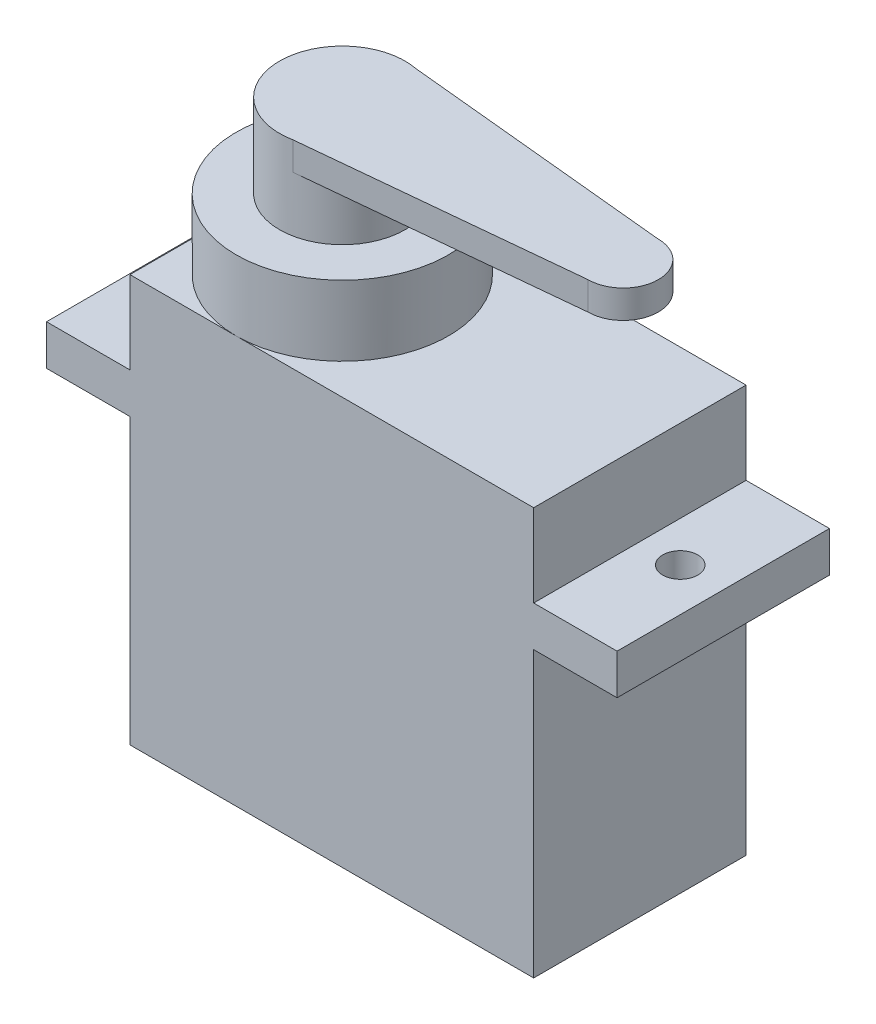
ISO-10303-21;
HEADER;
FILE_DESCRIPTION(('STEP AP214'),'2;1');
FILE_NAME('part.step','',(''),(''),'','','');
FILE_SCHEMA(('AUTOMOTIVE_DESIGN { 1 0 10303 214 1 1 1 1 }'));
ENDSEC;
DATA;
#1=APPLICATION_CONTEXT('core data for automotive mechanical design processes');
#2=APPLICATION_PROTOCOL_DEFINITION('international standard','automotive_design',2000,#1);
#3=PRODUCT_CONTEXT('',#1,'mechanical');
#4=PRODUCT('Part','Part','',(#3));
#5=PRODUCT_RELATED_PRODUCT_CATEGORY('part','',(#4));
#6=PRODUCT_DEFINITION_FORMATION('','',#4);
#7=PRODUCT_DEFINITION_CONTEXT('part definition',#1,'design');
#8=PRODUCT_DEFINITION('design','',#6,#7);
#9=PRODUCT_DEFINITION_SHAPE('','',#8);
#10=(LENGTH_UNIT() NAMED_UNIT(*) SI_UNIT(.MILLI.,.METRE.));
#11=(NAMED_UNIT(*) PLANE_ANGLE_UNIT() SI_UNIT($,.RADIAN.));
#12=(NAMED_UNIT(*) SI_UNIT($,.STERADIAN.) SOLID_ANGLE_UNIT());
#13=UNCERTAINTY_MEASURE_WITH_UNIT(LENGTH_MEASURE(1.E-05),#10,'distance_accuracy_value','');
#14=(GEOMETRIC_REPRESENTATION_CONTEXT(3) GLOBAL_UNCERTAINTY_ASSIGNED_CONTEXT((#13)) GLOBAL_UNIT_ASSIGNED_CONTEXT((#10,
#11,#12)) REPRESENTATION_CONTEXT('',''));
#15=CARTESIAN_POINT('',(0.,0.,0.));
#16=DIRECTION('',(0.,0.,1.));
#17=DIRECTION('',(1.,0.,0.));
#18=AXIS2_PLACEMENT_3D('',#15,#16,#17);
#19=CARTESIAN_POINT('',(0.,23.2,0.));
#20=DIRECTION('',(0.,1.,0.));
#21=DIRECTION('',(0.,0.,1.));
#22=AXIS2_PLACEMENT_3D('',#19,#20,#21);
#23=PLANE('',#22);
#24=CARTESIAN_POINT('',(-5.45,23.2,0.));
#25=DIRECTION('',(0.,1.,0.));
#26=DIRECTION('',(0.,0.,1.));
#27=AXIS2_PLACEMENT_3D('',#24,#25,#26);
#28=CIRCLE('',#27,6.05);
#29=CARTESIAN_POINT('',(-5.45,23.2,6.05));
#30=VERTEX_POINT('',#29);
#31=CARTESIAN_POINT('',(-5.45,23.2,-6.05));
#32=VERTEX_POINT('',#31);
#33=EDGE_CURVE('E216',#30,#32,#28,.T.);
#34=ORIENTED_EDGE('',*,*,#33,.F.);
#35=DIRECTION('',(1.,0.,0.));
#36=VECTOR('',#35,1.);
#37=CARTESIAN_POINT('',(11.5,23.2,6.05));
#38=LINE('',#37,#36);
#39=CARTESIAN_POINT('',(11.5,23.2,6.05));
#40=VERTEX_POINT('',#39);
#41=EDGE_CURVE('E319',#30,#40,#38,.T.);
#42=ORIENTED_EDGE('',*,*,#41,.T.);
#43=DIRECTION('',(0.,0.,-1.));
#44=VECTOR('',#43,1.);
#45=CARTESIAN_POINT('',(11.5,23.2,6.05));
#46=LINE('',#45,#44);
#47=CARTESIAN_POINT('',(11.5,23.2,-6.05));
#48=VERTEX_POINT('',#47);
#49=EDGE_CURVE('E324',#40,#48,#46,.T.);
#50=ORIENTED_EDGE('',*,*,#49,.T.);
#51=DIRECTION('',(-1.,0.,0.));
#52=VECTOR('',#51,1.);
#53=CARTESIAN_POINT('',(11.5,23.2,-6.05));
#54=LINE('',#53,#52);
#55=EDGE_CURVE('E328',#48,#32,#54,.T.);
#56=ORIENTED_EDGE('',*,*,#55,.T.);
#57=EDGE_LOOP('',(#34,#42,#50,#56));
#58=FACE_BOUND('',#57,.T.);
#59=ADVANCED_FACE('F41',(#58),#23,.T.);
#60=CARTESIAN_POINT('',(-11.5,23.2,0.));
#61=VERTEX_POINT('',#60);
#62=EDGE_CURVE('E51',#32,#61,#28,.T.);
#63=ORIENTED_EDGE('',*,*,#62,.F.);
#64=CARTESIAN_POINT('',(-11.5,23.2,-6.05));
#65=VERTEX_POINT('',#64);
#66=EDGE_CURVE('E327',#32,#65,#54,.T.);
#67=ORIENTED_EDGE('',*,*,#66,.T.);
#68=DIRECTION('',(0.,0.,1.));
#69=VECTOR('',#68,1.);
#70=CARTESIAN_POINT('',(-11.5,23.2,6.05));
#71=LINE('',#70,#69);
#72=EDGE_CURVE('E316',#65,#61,#71,.T.);
#73=ORIENTED_EDGE('',*,*,#72,.T.);
#74=EDGE_LOOP('',(#63,#67,#73));
#75=FACE_BOUND('',#74,.T.);
#76=ADVANCED_FACE('F410',(#75),#23,.T.);
#77=CARTESIAN_POINT('',(-11.5,23.2,6.05));
#78=DIRECTION('',(1.,0.,0.));
#79=DIRECTION('',(0.,0.,-1.));
#80=AXIS2_PLACEMENT_3D('',#77,#78,#79);
#81=PLANE('',#80);
#82=DIRECTION('',(0.,-1.,0.));
#83=VECTOR('',#82,1.);
#84=CARTESIAN_POINT('',(-11.5,23.2,6.05));
#85=LINE('',#84,#83);
#86=CARTESIAN_POINT('',(-11.5,16.2,6.05));
#87=VERTEX_POINT('',#86);
#88=CARTESIAN_POINT('',(-11.5,0.,6.05));
#89=VERTEX_POINT('',#88);
#90=EDGE_CURVE('E359',#87,#89,#85,.T.);
#91=ORIENTED_EDGE('',*,*,#90,.F.);
#92=DIRECTION('',(0.,0.,-1.));
#93=VECTOR('',#92,1.);
#94=CARTESIAN_POINT('',(-11.5,16.2,6.05));
#95=LINE('',#94,#93);
#96=CARTESIAN_POINT('',(-11.5,16.2,-6.05));
#97=VERTEX_POINT('',#96);
#98=EDGE_CURVE('E240',#87,#97,#95,.T.);
#99=ORIENTED_EDGE('',*,*,#98,.T.);
#100=DIRECTION('',(0.,-1.,0.));
#101=VECTOR('',#100,1.);
#102=CARTESIAN_POINT('',(-11.5,23.2,-6.05));
#103=LINE('',#102,#101);
#104=CARTESIAN_POINT('',(-11.5,0.,-6.05));
#105=VERTEX_POINT('',#104);
#106=EDGE_CURVE('E332',#97,#105,#103,.T.);
#107=ORIENTED_EDGE('',*,*,#106,.T.);
#108=DIRECTION('',(0.,0.,1.));
#109=VECTOR('',#108,1.);
#110=CARTESIAN_POINT('',(-11.5,0.,6.05));
#111=LINE('',#110,#109);
#112=EDGE_CURVE('E315',#105,#89,#111,.T.);
#113=ORIENTED_EDGE('',*,*,#112,.T.);
#114=EDGE_LOOP('',(#91,#99,#107,#113));
#115=FACE_BOUND('',#114,.T.);
#116=ADVANCED_FACE('F412',(#115),#81,.F.);
#117=CARTESIAN_POINT('',(11.5,23.2,6.05));
#118=DIRECTION('',(-1.,0.,0.));
#119=DIRECTION('',(0.,0.,1.));
#120=AXIS2_PLACEMENT_3D('',#117,#118,#119);
#121=PLANE('',#120);
#122=DIRECTION('',(0.,0.,1.));
#123=VECTOR('',#122,1.);
#124=CARTESIAN_POINT('',(11.5,18.5,6.05));
#125=LINE('',#124,#123);
#126=CARTESIAN_POINT('',(11.5,18.5,-6.05));
#127=VERTEX_POINT('',#126);
#128=CARTESIAN_POINT('',(11.5,18.5,6.05));
#129=VERTEX_POINT('',#128);
#130=EDGE_CURVE('E284',#127,#129,#125,.T.);
#131=ORIENTED_EDGE('',*,*,#130,.F.);
#132=DIRECTION('',(0.,-1.,0.));
#133=VECTOR('',#132,1.);
#134=CARTESIAN_POINT('',(11.5,23.2,-6.05));
#135=LINE('',#134,#133);
#136=EDGE_CURVE('E353',#48,#127,#135,.T.);
#137=ORIENTED_EDGE('',*,*,#136,.F.);
#138=ORIENTED_EDGE('',*,*,#49,.F.);
#139=DIRECTION('',(0.,-1.,0.));
#140=VECTOR('',#139,1.);
#141=CARTESIAN_POINT('',(11.5,23.2,6.05));
#142=LINE('',#141,#140);
#143=EDGE_CURVE('E357',#40,#129,#142,.T.);
#144=ORIENTED_EDGE('',*,*,#143,.T.);
#145=EDGE_LOOP('',(#131,#137,#138,#144));
#146=FACE_BOUND('',#145,.T.);
#147=ADVANCED_FACE('F418',(#146),#121,.F.);
#148=DIRECTION('',(0.,0.,-1.));
#149=VECTOR('',#148,1.);
#150=CARTESIAN_POINT('',(11.5,16.2,6.05));
#151=LINE('',#150,#149);
#152=CARTESIAN_POINT('',(11.5,16.2,6.05));
#153=VERTEX_POINT('',#152);
#154=CARTESIAN_POINT('',(11.5,16.2,-6.05));
#155=VERTEX_POINT('',#154);
#156=EDGE_CURVE('E278',#153,#155,#151,.T.);
#157=ORIENTED_EDGE('',*,*,#156,.F.);
#158=CARTESIAN_POINT('',(11.5,0.,6.05));
#159=VERTEX_POINT('',#158);
#160=EDGE_CURVE('E356',#153,#159,#142,.T.);
#161=ORIENTED_EDGE('',*,*,#160,.T.);
#162=DIRECTION('',(0.,0.,-1.));
#163=VECTOR('',#162,1.);
#164=CARTESIAN_POINT('',(11.5,0.,6.05));
#165=LINE('',#164,#163);
#166=CARTESIAN_POINT('',(11.5,0.,-6.05));
#167=VERTEX_POINT('',#166);
#168=EDGE_CURVE('E340',#159,#167,#165,.T.);
#169=ORIENTED_EDGE('',*,*,#168,.T.);
#170=EDGE_CURVE('E352',#155,#167,#135,.T.);
#171=ORIENTED_EDGE('',*,*,#170,.F.);
#172=EDGE_LOOP('',(#157,#161,#169,#171));
#173=FACE_BOUND('',#172,.T.);
#174=ADVANCED_FACE('F367',(#173),#121,.F.);
#175=CARTESIAN_POINT('',(-11.5,18.5,-6.05));
#176=VERTEX_POINT('',#175);
#177=EDGE_CURVE('E348',#65,#176,#103,.T.);
#178=ORIENTED_EDGE('',*,*,#177,.T.);
#179=DIRECTION('',(0.,0.,1.));
#180=VECTOR('',#179,1.);
#181=CARTESIAN_POINT('',(-11.5,18.5,6.05));
#182=LINE('',#181,#180);
#183=CARTESIAN_POINT('',(-11.5,18.5,6.05));
#184=VERTEX_POINT('',#183);
#185=EDGE_CURVE('E234',#176,#184,#182,.T.);
#186=ORIENTED_EDGE('',*,*,#185,.T.);
#187=CARTESIAN_POINT('',(-11.5,23.2,6.05));
#188=VERTEX_POINT('',#187);
#189=EDGE_CURVE('E45',#188,#184,#85,.T.);
#190=ORIENTED_EDGE('',*,*,#189,.F.);
#191=EDGE_CURVE('E320',#61,#188,#71,.T.);
#192=ORIENTED_EDGE('',*,*,#191,.F.);
#193=ORIENTED_EDGE('',*,*,#72,.F.);
#194=EDGE_LOOP('',(#178,#186,#190,#192,#193));
#195=FACE_BOUND('',#194,.T.);
#196=ADVANCED_FACE('F43',(#195),#81,.F.);
#197=CARTESIAN_POINT('',(11.5,23.2,6.05));
#198=DIRECTION('',(0.,0.,-1.));
#199=DIRECTION('',(-1.,0.,0.));
#200=AXIS2_PLACEMENT_3D('',#197,#198,#199);
#201=PLANE('',#200);
#202=DIRECTION('',(1.,0.,0.));
#203=VECTOR('',#202,1.);
#204=CARTESIAN_POINT('',(11.5,0.,6.05));
#205=LINE('',#204,#203);
#206=EDGE_CURVE('E336',#89,#159,#205,.T.);
#207=ORIENTED_EDGE('',*,*,#206,.T.);
#208=ORIENTED_EDGE('',*,*,#160,.F.);
#209=DIRECTION('',(-1.,0.,0.));
#210=VECTOR('',#209,1.);
#211=CARTESIAN_POINT('',(16.25,16.2,6.05));
#212=LINE('',#211,#210);
#213=CARTESIAN_POINT('',(16.25,16.2,6.05));
#214=VERTEX_POINT('',#213);
#215=EDGE_CURVE('E311',#214,#153,#212,.T.);
#216=ORIENTED_EDGE('',*,*,#215,.F.);
#217=DIRECTION('',(0.,-1.,0.));
#218=VECTOR('',#217,1.);
#219=CARTESIAN_POINT('',(16.25,18.5,6.05));
#220=LINE('',#219,#218);
#221=CARTESIAN_POINT('',(16.25,18.5,6.05));
#222=VERTEX_POINT('',#221);
#223=EDGE_CURVE('E279',#222,#214,#220,.T.);
#224=ORIENTED_EDGE('',*,*,#223,.F.);
#225=DIRECTION('',(-1.,0.,0.));
#226=VECTOR('',#225,1.);
#227=CARTESIAN_POINT('',(16.25,18.5,6.05));
#228=LINE('',#227,#226);
#229=EDGE_CURVE('E293',#222,#129,#228,.T.);
#230=ORIENTED_EDGE('',*,*,#229,.T.);
#231=ORIENTED_EDGE('',*,*,#143,.F.);
#232=ORIENTED_EDGE('',*,*,#41,.F.);
#233=EDGE_CURVE('E321',#188,#30,#38,.T.);
#234=ORIENTED_EDGE('',*,*,#233,.F.);
#235=ORIENTED_EDGE('',*,*,#189,.T.);
#236=DIRECTION('',(1.,0.,0.));
#237=VECTOR('',#236,1.);
#238=CARTESIAN_POINT('',(-16.25,18.5,6.05));
#239=LINE('',#238,#237);
#240=CARTESIAN_POINT('',(-16.25,18.5,6.05));
#241=VERTEX_POINT('',#240);
#242=EDGE_CURVE('E267',#241,#184,#239,.T.);
#243=ORIENTED_EDGE('',*,*,#242,.F.);
#244=DIRECTION('',(0.,-1.,0.));
#245=VECTOR('',#244,1.);
#246=CARTESIAN_POINT('',(-16.25,18.5,6.05));
#247=LINE('',#246,#245);
#248=CARTESIAN_POINT('',(-16.25,16.2,6.05));
#249=VERTEX_POINT('',#248);
#250=EDGE_CURVE('E235',#241,#249,#247,.T.);
#251=ORIENTED_EDGE('',*,*,#250,.T.);
#252=DIRECTION('',(1.,0.,0.));
#253=VECTOR('',#252,1.);
#254=CARTESIAN_POINT('',(-16.25,16.2,6.05));
#255=LINE('',#254,#253);
#256=EDGE_CURVE('E252',#249,#87,#255,.T.);
#257=ORIENTED_EDGE('',*,*,#256,.T.);
#258=ORIENTED_EDGE('',*,*,#90,.T.);
#259=EDGE_LOOP('',(#207,#208,#216,#224,#230,#231,#232,#234,#235,#243,#251,#257,#258));
#260=FACE_BOUND('',#259,.T.);
#261=ADVANCED_FACE('F373',(#260),#201,.F.);
#262=CARTESIAN_POINT('',(11.5,23.2,-6.05));
#263=DIRECTION('',(0.,0.,1.));
#264=DIRECTION('',(1.,0.,0.));
#265=AXIS2_PLACEMENT_3D('',#262,#263,#264);
#266=PLANE('',#265);
#267=DIRECTION('',(-1.,0.,0.));
#268=VECTOR('',#267,1.);
#269=CARTESIAN_POINT('',(11.5,0.,-6.05));
#270=LINE('',#269,#268);
#271=EDGE_CURVE('E344',#167,#105,#270,.T.);
#272=ORIENTED_EDGE('',*,*,#271,.T.);
#273=ORIENTED_EDGE('',*,*,#106,.F.);
#274=DIRECTION('',(1.,0.,0.));
#275=VECTOR('',#274,1.);
#276=CARTESIAN_POINT('',(-16.25,16.2,-6.05));
#277=LINE('',#276,#275);
#278=CARTESIAN_POINT('',(-16.25,16.2,-6.05));
#279=VERTEX_POINT('',#278);
#280=EDGE_CURVE('E261',#279,#97,#277,.T.);
#281=ORIENTED_EDGE('',*,*,#280,.F.);
#282=DIRECTION('',(0.,1.,0.));
#283=VECTOR('',#282,1.);
#284=CARTESIAN_POINT('',(-16.25,18.5,-6.05));
#285=LINE('',#284,#283);
#286=CARTESIAN_POINT('',(-16.25,18.5,-6.05));
#287=VERTEX_POINT('',#286);
#288=EDGE_CURVE('E244',#279,#287,#285,.T.);
#289=ORIENTED_EDGE('',*,*,#288,.T.);
#290=DIRECTION('',(1.,0.,0.));
#291=VECTOR('',#290,1.);
#292=CARTESIAN_POINT('',(-16.25,18.5,-6.05));
#293=LINE('',#292,#291);
#294=EDGE_CURVE('E264',#287,#176,#293,.T.);
#295=ORIENTED_EDGE('',*,*,#294,.T.);
#296=ORIENTED_EDGE('',*,*,#177,.F.);
#297=ORIENTED_EDGE('',*,*,#66,.F.);
#298=ORIENTED_EDGE('',*,*,#55,.F.);
#299=ORIENTED_EDGE('',*,*,#136,.T.);
#300=DIRECTION('',(-1.,0.,0.));
#301=VECTOR('',#300,1.);
#302=CARTESIAN_POINT('',(16.25,18.5,-6.05));
#303=LINE('',#302,#301);
#304=CARTESIAN_POINT('',(16.25,18.5,-6.05));
#305=VERTEX_POINT('',#304);
#306=EDGE_CURVE('E303',#305,#127,#303,.T.);
#307=ORIENTED_EDGE('',*,*,#306,.F.);
#308=DIRECTION('',(0.,1.,0.));
#309=VECTOR('',#308,1.);
#310=CARTESIAN_POINT('',(16.25,18.5,-6.05));
#311=LINE('',#310,#309);
#312=CARTESIAN_POINT('',(16.25,16.2,-6.05));
#313=VERTEX_POINT('',#312);
#314=EDGE_CURVE('E287',#313,#305,#311,.T.);
#315=ORIENTED_EDGE('',*,*,#314,.F.);
#316=DIRECTION('',(-1.,0.,0.));
#317=VECTOR('',#316,1.);
#318=CARTESIAN_POINT('',(16.25,16.2,-6.05));
#319=LINE('',#318,#317);
#320=EDGE_CURVE('E307',#313,#155,#319,.T.);
#321=ORIENTED_EDGE('',*,*,#320,.T.);
#322=ORIENTED_EDGE('',*,*,#170,.T.);
#323=EDGE_LOOP('',(#272,#273,#281,#289,#295,#296,#297,#298,#299,#307,#315,#321,#322));
#324=FACE_BOUND('',#323,.T.);
#325=ADVANCED_FACE('F380',(#324),#266,.F.);
#326=EDGE_CURVE('E226',#61,#30,#28,.T.);
#327=ORIENTED_EDGE('',*,*,#326,.F.);
#328=ORIENTED_EDGE('',*,*,#191,.T.);
#329=ORIENTED_EDGE('',*,*,#233,.T.);
#330=EDGE_LOOP('',(#327,#328,#329));
#331=FACE_BOUND('',#330,.T.);
#332=ADVANCED_FACE('F391',(#331),#23,.T.);
#333=CARTESIAN_POINT('',(0.,0.,0.));
#334=DIRECTION('',(0.,1.,0.));
#335=DIRECTION('',(0.,0.,1.));
#336=AXIS2_PLACEMENT_3D('',#333,#334,#335);
#337=PLANE('',#336);
#338=ORIENTED_EDGE('',*,*,#112,.F.);
#339=ORIENTED_EDGE('',*,*,#271,.F.);
#340=ORIENTED_EDGE('',*,*,#168,.F.);
#341=ORIENTED_EDGE('',*,*,#206,.F.);
#342=EDGE_LOOP('',(#338,#339,#340,#341));
#343=FACE_BOUND('',#342,.T.);
#344=ADVANCED_FACE('F377',(#343),#337,.F.);
#345=CARTESIAN_POINT('',(16.25,16.2,6.05));
#346=DIRECTION('',(0.,1.,0.));
#347=DIRECTION('',(0.,0.,1.));
#348=AXIS2_PLACEMENT_3D('',#345,#346,#347);
#349=PLANE('',#348);
#350=CARTESIAN_POINT('',(13.8,16.2,0.));
#351=DIRECTION('',(0.,1.,0.));
#352=DIRECTION('',(0.,0.,1.));
#353=AXIS2_PLACEMENT_3D('',#350,#351,#352);
#354=CIRCLE('',#353,1.);
#355=CARTESIAN_POINT('',(13.8,16.2,1.));
#356=VERTEX_POINT('',#355);
#357=EDGE_CURVE('E274',#356,#356,#354,.F.);
#358=ORIENTED_EDGE('',*,*,#357,.F.);
#359=EDGE_LOOP('',(#358));
#360=FACE_BOUND('',#359,.T.);
#361=ORIENTED_EDGE('',*,*,#156,.T.);
#362=ORIENTED_EDGE('',*,*,#320,.F.);
#363=DIRECTION('',(0.,0.,-1.));
#364=VECTOR('',#363,1.);
#365=CARTESIAN_POINT('',(16.25,16.2,6.05));
#366=LINE('',#365,#364);
#367=EDGE_CURVE('E283',#214,#313,#366,.T.);
#368=ORIENTED_EDGE('',*,*,#367,.F.);
#369=ORIENTED_EDGE('',*,*,#215,.T.);
#370=EDGE_LOOP('',(#361,#362,#368,#369));
#371=FACE_BOUND('',#370,.T.);
#372=ADVANCED_FACE('F427',(#360,#371),#349,.F.);
#373=CARTESIAN_POINT('',(16.25,18.5,6.05));
#374=DIRECTION('',(0.,-1.,0.));
#375=DIRECTION('',(0.,0.,-1.));
#376=AXIS2_PLACEMENT_3D('',#373,#374,#375);
#377=PLANE('',#376);
#378=CARTESIAN_POINT('',(13.8,18.5,0.));
#379=DIRECTION('',(0.,1.,0.));
#380=DIRECTION('',(0.,0.,1.));
#381=AXIS2_PLACEMENT_3D('',#378,#379,#380);
#382=CIRCLE('',#381,1.);
#383=CARTESIAN_POINT('',(13.8,18.5,1.));
#384=VERTEX_POINT('',#383);
#385=EDGE_CURVE('E270',#384,#384,#382,.T.);
#386=ORIENTED_EDGE('',*,*,#385,.F.);
#387=EDGE_LOOP('',(#386));
#388=FACE_BOUND('',#387,.T.);
#389=ORIENTED_EDGE('',*,*,#130,.T.);
#390=ORIENTED_EDGE('',*,*,#229,.F.);
#391=DIRECTION('',(0.,0.,1.));
#392=VECTOR('',#391,1.);
#393=CARTESIAN_POINT('',(16.25,18.5,6.05));
#394=LINE('',#393,#392);
#395=EDGE_CURVE('E290',#305,#222,#394,.T.);
#396=ORIENTED_EDGE('',*,*,#395,.F.);
#397=ORIENTED_EDGE('',*,*,#306,.T.);
#398=EDGE_LOOP('',(#389,#390,#396,#397));
#399=FACE_BOUND('',#398,.T.);
#400=ADVANCED_FACE('F439',(#388,#399),#377,.F.);
#401=CARTESIAN_POINT('',(16.25,0.,0.));
#402=DIRECTION('',(1.,0.,0.));
#403=DIRECTION('',(0.,0.,-1.));
#404=AXIS2_PLACEMENT_3D('',#401,#402,#403);
#405=PLANE('',#404);
#406=ORIENTED_EDGE('',*,*,#223,.T.);
#407=ORIENTED_EDGE('',*,*,#367,.T.);
#408=ORIENTED_EDGE('',*,*,#314,.T.);
#409=ORIENTED_EDGE('',*,*,#395,.T.);
#410=EDGE_LOOP('',(#406,#407,#408,#409));
#411=FACE_BOUND('',#410,.T.);
#412=ADVANCED_FACE('F443',(#411),#405,.T.);
#413=CARTESIAN_POINT('',(13.8,13.3715728752538,0.));
#414=DIRECTION('',(0.,1.,0.));
#415=DIRECTION('',(0.,0.,1.));
#416=AXIS2_PLACEMENT_3D('',#413,#414,#415);
#417=CYLINDRICAL_SURFACE('',#416,1.);
#418=ORIENTED_EDGE('',*,*,#357,.T.);
#419=EDGE_LOOP('',(#418));
#420=FACE_BOUND('',#419,.T.);
#421=ORIENTED_EDGE('',*,*,#385,.T.);
#422=EDGE_LOOP('',(#421));
#423=FACE_BOUND('',#422,.T.);
#424=ADVANCED_FACE('F456',(#420,#423),#417,.F.);
#425=CARTESIAN_POINT('',(-16.25,18.5,6.05));
#426=DIRECTION('',(0.,1.,0.));
#427=DIRECTION('',(0.,0.,1.));
#428=AXIS2_PLACEMENT_3D('',#425,#426,#427);
#429=PLANE('',#428);
#430=CARTESIAN_POINT('',(-13.8,18.5,0.));
#431=DIRECTION('',(0.,-1.,0.));
#432=DIRECTION('',(0.,0.,1.));
#433=AXIS2_PLACEMENT_3D('',#430,#431,#432);
#434=CIRCLE('',#433,1.);
#435=CARTESIAN_POINT('',(-13.8,18.5,1.));
#436=VERTEX_POINT('',#435);
#437=EDGE_CURVE('E222',#436,#436,#434,.T.);
#438=ORIENTED_EDGE('',*,*,#437,.T.);
#439=EDGE_LOOP('',(#438));
#440=FACE_BOUND('',#439,.T.);
#441=ORIENTED_EDGE('',*,*,#185,.F.);
#442=ORIENTED_EDGE('',*,*,#294,.F.);
#443=DIRECTION('',(0.,0.,1.));
#444=VECTOR('',#443,1.);
#445=CARTESIAN_POINT('',(-16.25,18.5,6.05));
#446=LINE('',#445,#444);
#447=EDGE_CURVE('E239',#287,#241,#446,.T.);
#448=ORIENTED_EDGE('',*,*,#447,.T.);
#449=ORIENTED_EDGE('',*,*,#242,.T.);
#450=EDGE_LOOP('',(#441,#442,#448,#449));
#451=FACE_BOUND('',#450,.T.);
#452=ADVANCED_FACE('F459',(#440,#451),#429,.T.);
#453=CARTESIAN_POINT('',(-16.25,16.2,6.05));
#454=DIRECTION('',(0.,-1.,0.));
#455=DIRECTION('',(0.,0.,-1.));
#456=AXIS2_PLACEMENT_3D('',#453,#454,#455);
#457=PLANE('',#456);
#458=CARTESIAN_POINT('',(-13.8,16.2,0.));
#459=DIRECTION('',(0.,1.,0.));
#460=DIRECTION('',(0.,0.,1.));
#461=AXIS2_PLACEMENT_3D('',#458,#459,#460);
#462=CIRCLE('',#461,1.);
#463=CARTESIAN_POINT('',(-13.8,16.2,1.));
#464=VERTEX_POINT('',#463);
#465=EDGE_CURVE('E230',#464,#464,#462,.T.);
#466=ORIENTED_EDGE('',*,*,#465,.T.);
#467=EDGE_LOOP('',(#466));
#468=FACE_BOUND('',#467,.T.);
#469=ORIENTED_EDGE('',*,*,#98,.F.);
#470=ORIENTED_EDGE('',*,*,#256,.F.);
#471=DIRECTION('',(0.,0.,-1.));
#472=VECTOR('',#471,1.);
#473=CARTESIAN_POINT('',(-16.25,16.2,6.05));
#474=LINE('',#473,#472);
#475=EDGE_CURVE('E248',#249,#279,#474,.T.);
#476=ORIENTED_EDGE('',*,*,#475,.T.);
#477=ORIENTED_EDGE('',*,*,#280,.T.);
#478=EDGE_LOOP('',(#469,#470,#476,#477));
#479=FACE_BOUND('',#478,.T.);
#480=ADVANCED_FACE('F463',(#468,#479),#457,.T.);
#481=CARTESIAN_POINT('',(-16.25,0.,0.));
#482=DIRECTION('',(-1.,0.,0.));
#483=DIRECTION('',(0.,0.,-1.));
#484=AXIS2_PLACEMENT_3D('',#481,#482,#483);
#485=PLANE('',#484);
#486=ORIENTED_EDGE('',*,*,#250,.F.);
#487=ORIENTED_EDGE('',*,*,#447,.F.);
#488=ORIENTED_EDGE('',*,*,#288,.F.);
#489=ORIENTED_EDGE('',*,*,#475,.F.);
#490=EDGE_LOOP('',(#486,#487,#488,#489));
#491=FACE_BOUND('',#490,.T.);
#492=ADVANCED_FACE('F467',(#491),#485,.T.);
#493=CARTESIAN_POINT('',(-13.8,13.3715728752538,0.));
#494=DIRECTION('',(0.,1.,0.));
#495=DIRECTION('',(0.,0.,1.));
#496=AXIS2_PLACEMENT_3D('',#493,#494,#495);
#497=CYLINDRICAL_SURFACE('',#496,1.);
#498=ORIENTED_EDGE('',*,*,#465,.F.);
#499=EDGE_LOOP('',(#498));
#500=FACE_BOUND('',#499,.T.);
#501=ORIENTED_EDGE('',*,*,#437,.F.);
#502=EDGE_LOOP('',(#501));
#503=FACE_BOUND('',#502,.T.);
#504=ADVANCED_FACE('F471',(#500,#503),#497,.F.);
#505=CARTESIAN_POINT('',(-5.45,27.2,0.));
#506=DIRECTION('',(0.,-1.,0.));
#507=DIRECTION('',(0.,0.,-1.));
#508=AXIS2_PLACEMENT_3D('',#505,#506,#507);
#509=CYLINDRICAL_SURFACE('',#508,6.05);
#510=CARTESIAN_POINT('',(-5.45,27.2,0.));
#511=DIRECTION('',(0.,1.,0.));
#512=DIRECTION('',(0.,0.,1.));
#513=AXIS2_PLACEMENT_3D('',#510,#511,#512);
#514=CIRCLE('',#513,6.05);
#515=CARTESIAN_POINT('',(-5.45,27.2,6.05));
#516=VERTEX_POINT('',#515);
#517=EDGE_CURVE('E218',#516,#516,#514,.T.);
#518=ORIENTED_EDGE('',*,*,#517,.F.);
#519=EDGE_LOOP('',(#518));
#520=FACE_BOUND('',#519,.T.);
#521=ORIENTED_EDGE('',*,*,#33,.T.);
#522=ORIENTED_EDGE('',*,*,#62,.T.);
#523=ORIENTED_EDGE('',*,*,#326,.T.);
#524=EDGE_LOOP('',(#521,#522,#523));
#525=FACE_BOUND('',#524,.T.);
#526=ADVANCED_FACE('F404',(#520,#525),#509,.T.);
#527=CARTESIAN_POINT('',(-5.45,27.2,0.));
#528=DIRECTION('',(0.,1.,0.));
#529=DIRECTION('',(0.,0.,1.));
#530=AXIS2_PLACEMENT_3D('',#527,#528,#529);
#531=PLANE('',#530);
#532=CARTESIAN_POINT('',(-5.45,27.2,0.));
#533=DIRECTION('',(0.,1.,0.));
#534=DIRECTION('',(0.,0.,1.));
#535=AXIS2_PLACEMENT_3D('',#532,#533,#534);
#536=CIRCLE('',#535,3.575);
#537=CARTESIAN_POINT('',(-5.45,27.2,3.575));
#538=VERTEX_POINT('',#537);
#539=EDGE_CURVE('E11',#538,#538,#536,.T.);
#540=ORIENTED_EDGE('',*,*,#539,.F.);
#541=EDGE_LOOP('',(#540));
#542=FACE_BOUND('',#541,.T.);
#543=ORIENTED_EDGE('',*,*,#517,.T.);
#544=EDGE_LOOP('',(#543));
#545=FACE_BOUND('',#544,.T.);
#546=ADVANCED_FACE('F478',(#542,#545),#531,.T.);
#547=CARTESIAN_POINT('',(-5.45,31.95,0.));
#548=DIRECTION('',(0.,-1.,0.));
#549=DIRECTION('',(0.,0.,-1.));
#550=AXIS2_PLACEMENT_3D('',#547,#548,#549);
#551=CYLINDRICAL_SURFACE('',#550,3.575);
#552=CARTESIAN_POINT('',(-5.45,30.35,0.));
#553=DIRECTION('',(0.,1.,0.));
#554=DIRECTION('',(0.,0.,1.));
#555=AXIS2_PLACEMENT_3D('',#552,#553,#554);
#556=CIRCLE('',#555,3.575);
#557=CARTESIAN_POINT('',(-4.75292647659762,30.35,3.50638182504008));
#558=VERTEX_POINT('',#557);
#559=CARTESIAN_POINT('',(-4.75292647659761,30.35,-3.50638182504008));
#560=VERTEX_POINT('',#559);
#561=EDGE_CURVE('E178',#558,#560,#556,.T.);
#562=ORIENTED_EDGE('',*,*,#561,.F.);
#563=DIRECTION('',(0.,1.,0.));
#564=VECTOR('',#563,1.);
#565=CARTESIAN_POINT('',(-4.75292647659762,30.35,3.50638182504008));
#566=LINE('',#565,#564);
#567=CARTESIAN_POINT('',(-4.75292647659762,31.95,3.50638182504008));
#568=VERTEX_POINT('',#567);
#569=EDGE_CURVE('E192',#558,#568,#566,.T.);
#570=ORIENTED_EDGE('',*,*,#569,.T.);
#571=CARTESIAN_POINT('',(-5.45,31.95,0.));
#572=DIRECTION('',(0.,1.,0.));
#573=DIRECTION('',(0.,0.,1.));
#574=AXIS2_PLACEMENT_3D('',#571,#572,#573);
#575=CIRCLE('',#574,3.575);
#576=CARTESIAN_POINT('',(-4.75292647659762,31.95,-3.50638182504008));
#577=VERTEX_POINT('',#576);
#578=EDGE_CURVE('E209',#577,#568,#575,.T.);
#579=ORIENTED_EDGE('',*,*,#578,.F.);
#580=DIRECTION('',(0.,1.,0.));
#581=VECTOR('',#580,1.);
#582=CARTESIAN_POINT('',(-4.75292647659761,30.35,-3.50638182504008));
#583=LINE('',#582,#581);
#584=EDGE_CURVE('E210',#560,#577,#583,.T.);
#585=ORIENTED_EDGE('',*,*,#584,.F.);
#586=EDGE_LOOP('',(#562,#570,#579,#585));
#587=FACE_BOUND('',#586,.T.);
#588=ORIENTED_EDGE('',*,*,#539,.T.);
#589=EDGE_LOOP('',(#588));
#590=FACE_BOUND('',#589,.T.);
#591=ADVANCED_FACE('F482',(#587,#590),#551,.T.);
#592=CARTESIAN_POINT('',(-5.45,31.95,0.));
#593=DIRECTION('',(0.,1.,0.));
#594=DIRECTION('',(0.,0.,1.));
#595=AXIS2_PLACEMENT_3D('',#592,#593,#594);
#596=PLANE('',#595);
#597=ORIENTED_EDGE('',*,*,#578,.T.);
#598=DIRECTION('',(0.995189957974435,0.,-0.0979640114881084));
#599=VECTOR('',#598,1.);
#600=CARTESIAN_POINT('',(0.296233397570901,31.95,3.00935514992661));
#601=LINE('',#600,#599);
#602=CARTESIAN_POINT('',(10.55,31.95,2.));
#603=VERTEX_POINT('',#602);
#604=EDGE_CURVE('E202',#568,#603,#601,.T.);
#605=ORIENTED_EDGE('',*,*,#604,.T.);
#606=CARTESIAN_POINT('',(10.55,31.95,0.));
#607=DIRECTION('',(0.,1.,0.));
#608=DIRECTION('',(0.,0.,1.));
#609=AXIS2_PLACEMENT_3D('',#606,#607,#608);
#610=CIRCLE('',#609,2.);
#611=CARTESIAN_POINT('',(10.55,31.95,-2.));
#612=VERTEX_POINT('',#611);
#613=EDGE_CURVE('E172',#603,#612,#610,.T.);
#614=ORIENTED_EDGE('',*,*,#613,.T.);
#615=DIRECTION('',(0.995189957974435,0.,0.0979640114881084));
#616=VECTOR('',#615,1.);
#617=CARTESIAN_POINT('',(0.296233397570901,31.95,-3.00935514992661));
#618=LINE('',#617,#616);
#619=EDGE_CURVE('E59',#577,#612,#618,.T.);
#620=ORIENTED_EDGE('',*,*,#619,.F.);
#621=EDGE_LOOP('',(#597,#605,#614,#620));
#622=FACE_BOUND('',#621,.T.);
#623=ADVANCED_FACE('F486',(#622),#596,.T.);
#624=CARTESIAN_POINT('',(0.296233397570901,30.35,3.00935514992661));
#625=DIRECTION('',(0.0979640114881084,0.,0.995189957974435));
#626=DIRECTION('',(0.995189957974435,0.,-0.0979640114881084));
#627=AXIS2_PLACEMENT_3D('',#624,#625,#626);
#628=PLANE('',#627);
#629=ORIENTED_EDGE('',*,*,#604,.F.);
#630=ORIENTED_EDGE('',*,*,#569,.F.);
#631=DIRECTION('',(0.995189957974435,0.,-0.0979640114881084));
#632=VECTOR('',#631,1.);
#633=CARTESIAN_POINT('',(0.296233397570901,30.35,3.00935514992661));
#634=LINE('',#633,#632);
#635=CARTESIAN_POINT('',(10.55,30.35,2.));
#636=VERTEX_POINT('',#635);
#637=EDGE_CURVE('E183',#558,#636,#634,.T.);
#638=ORIENTED_EDGE('',*,*,#637,.T.);
#639=DIRECTION('',(0.,1.,0.));
#640=VECTOR('',#639,1.);
#641=CARTESIAN_POINT('',(10.55,30.35,2.));
#642=LINE('',#641,#640);
#643=EDGE_CURVE('E168',#636,#603,#642,.T.);
#644=ORIENTED_EDGE('',*,*,#643,.T.);
#645=EDGE_LOOP('',(#629,#630,#638,#644));
#646=FACE_BOUND('',#645,.T.);
#647=ADVANCED_FACE('F190',(#646),#628,.T.);
#648=CARTESIAN_POINT('',(0.296233397570901,30.35,-3.00935514992661));
#649=DIRECTION('',(-0.0979640114881084,0.,0.995189957974435));
#650=DIRECTION('',(0.995189957974435,0.,0.0979640114881084));
#651=AXIS2_PLACEMENT_3D('',#648,#649,#650);
#652=PLANE('',#651);
#653=ORIENTED_EDGE('',*,*,#619,.T.);
#654=DIRECTION('',(0.,1.,0.));
#655=VECTOR('',#654,1.);
#656=CARTESIAN_POINT('',(10.55,30.35,-2.));
#657=LINE('',#656,#655);
#658=CARTESIAN_POINT('',(10.55,30.35,-2.));
#659=VERTEX_POINT('',#658);
#660=EDGE_CURVE('E177',#659,#612,#657,.T.);
#661=ORIENTED_EDGE('',*,*,#660,.F.);
#662=DIRECTION('',(0.995189957974435,0.,0.0979640114881084));
#663=VECTOR('',#662,1.);
#664=CARTESIAN_POINT('',(0.296233397570901,30.35,-3.00935514992661));
#665=LINE('',#664,#663);
#666=EDGE_CURVE('E186',#560,#659,#665,.T.);
#667=ORIENTED_EDGE('',*,*,#666,.F.);
#668=ORIENTED_EDGE('',*,*,#584,.T.);
#669=EDGE_LOOP('',(#653,#661,#667,#668));
#670=FACE_BOUND('',#669,.T.);
#671=ADVANCED_FACE('F492',(#670),#652,.F.);
#672=CARTESIAN_POINT('',(10.55,30.35,0.));
#673=DIRECTION('',(0.,1.,0.));
#674=DIRECTION('',(0.,0.,1.));
#675=AXIS2_PLACEMENT_3D('',#672,#673,#674);
#676=CYLINDRICAL_SURFACE('',#675,2.);
#677=ORIENTED_EDGE('',*,*,#613,.F.);
#678=ORIENTED_EDGE('',*,*,#643,.F.);
#679=CARTESIAN_POINT('',(10.55,30.35,0.));
#680=DIRECTION('',(0.,1.,0.));
#681=DIRECTION('',(0.,0.,1.));
#682=AXIS2_PLACEMENT_3D('',#679,#680,#681);
#683=CIRCLE('',#682,2.);
#684=EDGE_CURVE('E171',#636,#659,#683,.T.);
#685=ORIENTED_EDGE('',*,*,#684,.T.);
#686=ORIENTED_EDGE('',*,*,#660,.T.);
#687=EDGE_LOOP('',(#677,#678,#685,#686));
#688=FACE_BOUND('',#687,.T.);
#689=ADVANCED_FACE('F170',(#688),#676,.T.);
#690=CARTESIAN_POINT('',(0.,30.35,0.));
#691=DIRECTION('',(0.,1.,0.));
#692=DIRECTION('',(0.,0.,1.));
#693=AXIS2_PLACEMENT_3D('',#690,#691,#692);
#694=PLANE('',#693);
#695=ORIENTED_EDGE('',*,*,#637,.F.);
#696=ORIENTED_EDGE('',*,*,#561,.T.);
#697=ORIENTED_EDGE('',*,*,#666,.T.);
#698=ORIENTED_EDGE('',*,*,#684,.F.);
#699=EDGE_LOOP('',(#695,#696,#697,#698));
#700=FACE_BOUND('',#699,.T.);
#701=ADVANCED_FACE('F182',(#700),#694,.F.);
#702=CLOSED_SHELL('',(#59,#76,#116,#147,#174,#196,#261,#325,#332,#344,#372,#400,#412,#424,#452,
#480,#492,#504,#526,#546,#591,#623,#647,#671,#689,#701));
#703=MANIFOLD_SOLID_BREP('B2',#702);
#704=ADVANCED_BREP_SHAPE_REPRESENTATION('',(#18,#703),#14);
#705=SHAPE_DEFINITION_REPRESENTATION(#9,#704);
ENDSEC;
END-ISO-10303-21;
